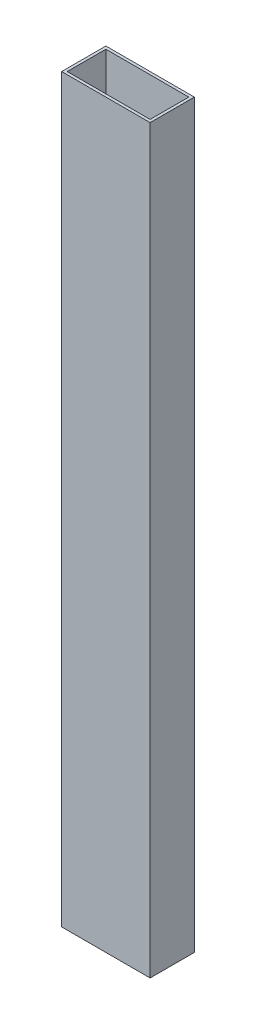
ISO-10303-21;
HEADER;
FILE_DESCRIPTION(('STEP AP214'),'2;1');
FILE_NAME('part.step','',(''),(''),'','','');
FILE_SCHEMA(('AUTOMOTIVE_DESIGN { 1 0 10303 214 1 1 1 1 }'));
ENDSEC;
DATA;
#1=APPLICATION_CONTEXT('core data for automotive mechanical design processes');
#2=APPLICATION_PROTOCOL_DEFINITION('international standard','automotive_design',2000,#1);
#3=PRODUCT_CONTEXT('',#1,'mechanical');
#4=PRODUCT('Part','Part','',(#3));
#5=PRODUCT_RELATED_PRODUCT_CATEGORY('part','',(#4));
#6=PRODUCT_DEFINITION_FORMATION('','',#4);
#7=PRODUCT_DEFINITION_CONTEXT('part definition',#1,'design');
#8=PRODUCT_DEFINITION('design','',#6,#7);
#9=PRODUCT_DEFINITION_SHAPE('','',#8);
#10=(LENGTH_UNIT() NAMED_UNIT(*) SI_UNIT(.MILLI.,.METRE.));
#11=(NAMED_UNIT(*) PLANE_ANGLE_UNIT() SI_UNIT($,.RADIAN.));
#12=(NAMED_UNIT(*) SI_UNIT($,.STERADIAN.) SOLID_ANGLE_UNIT());
#13=UNCERTAINTY_MEASURE_WITH_UNIT(LENGTH_MEASURE(1.E-05),#10,'distance_accuracy_value','');
#14=(GEOMETRIC_REPRESENTATION_CONTEXT(3) GLOBAL_UNCERTAINTY_ASSIGNED_CONTEXT((#13)) GLOBAL_UNIT_ASSIGNED_CONTEXT((#10,
#11,#12)) REPRESENTATION_CONTEXT('',''));
#15=CARTESIAN_POINT('',(0.,0.,0.));
#16=DIRECTION('',(0.,0.,1.));
#17=DIRECTION('',(1.,0.,0.));
#18=AXIS2_PLACEMENT_3D('',#15,#16,#17);
#19=CARTESIAN_POINT('',(0.,425.45,0.));
#20=DIRECTION('',(0.,1.,0.));
#21=DIRECTION('',(0.,0.,1.));
#22=AXIS2_PLACEMENT_3D('',#19,#20,#21);
#23=PLANE('',#22);
#24=DIRECTION('',(0.,0.,1.));
#25=VECTOR('',#24,1.);
#26=CARTESIAN_POINT('',(-49.2125,425.45,-23.8125));
#27=LINE('',#26,#25);
#28=CARTESIAN_POINT('',(-49.2125,425.45,-23.8125));
#29=VERTEX_POINT('',#28);
#30=CARTESIAN_POINT('',(-49.2125,425.45,1.5875));
#31=VERTEX_POINT('',#30);
#32=EDGE_CURVE('E155',#29,#31,#27,.T.);
#33=ORIENTED_EDGE('',*,*,#32,.T.);
#34=DIRECTION('',(1.,0.,0.));
#35=VECTOR('',#34,1.);
#36=CARTESIAN_POINT('',(-49.2125,425.45,1.5875));
#37=LINE('',#36,#35);
#38=CARTESIAN_POINT('',(1.5875,425.45,1.5875));
#39=VERTEX_POINT('',#38);
#40=EDGE_CURVE('E159',#31,#39,#37,.T.);
#41=ORIENTED_EDGE('',*,*,#40,.T.);
#42=DIRECTION('',(0.,0.,-1.));
#43=VECTOR('',#42,1.);
#44=CARTESIAN_POINT('',(1.5875,425.45,-23.8125));
#45=LINE('',#44,#43);
#46=CARTESIAN_POINT('',(1.5875,425.45,-23.8125));
#47=VERTEX_POINT('',#46);
#48=EDGE_CURVE('E163',#39,#47,#45,.T.);
#49=ORIENTED_EDGE('',*,*,#48,.T.);
#50=DIRECTION('',(-1.,0.,0.));
#51=VECTOR('',#50,1.);
#52=CARTESIAN_POINT('',(-49.2125,425.45,-23.8125));
#53=LINE('',#52,#51);
#54=EDGE_CURVE('E166',#47,#29,#53,.T.);
#55=ORIENTED_EDGE('',*,*,#54,.T.);
#56=EDGE_LOOP('',(#33,#41,#49,#55));
#57=FACE_BOUND('',#56,.T.);
#58=DIRECTION('',(1.,0.,0.));
#59=VECTOR('',#58,1.);
#60=CARTESIAN_POINT('',(-47.625,425.45,0.));
#61=LINE('',#60,#59);
#62=CARTESIAN_POINT('',(-47.625,425.45,0.));
#63=VERTEX_POINT('',#62);
#64=CARTESIAN_POINT('',(0.,425.45,0.));
#65=VERTEX_POINT('',#64);
#66=EDGE_CURVE('E116',#63,#65,#61,.T.);
#67=ORIENTED_EDGE('',*,*,#66,.F.);
#68=DIRECTION('',(0.,0.,1.));
#69=VECTOR('',#68,1.);
#70=CARTESIAN_POINT('',(-47.625,425.45,-22.225));
#71=LINE('',#70,#69);
#72=CARTESIAN_POINT('',(-47.625,425.45,-22.225));
#73=VERTEX_POINT('',#72);
#74=EDGE_CURVE('E107',#73,#63,#71,.T.);
#75=ORIENTED_EDGE('',*,*,#74,.F.);
#76=DIRECTION('',(-1.,0.,0.));
#77=VECTOR('',#76,1.);
#78=CARTESIAN_POINT('',(-47.625,425.45,-22.225));
#79=LINE('',#78,#77);
#80=CARTESIAN_POINT('',(0.,425.45,-22.225));
#81=VERTEX_POINT('',#80);
#82=EDGE_CURVE('E133',#81,#73,#79,.T.);
#83=ORIENTED_EDGE('',*,*,#82,.F.);
#84=DIRECTION('',(0.,0.,-1.));
#85=VECTOR('',#84,1.);
#86=CARTESIAN_POINT('',(0.,425.45,-22.225));
#87=LINE('',#86,#85);
#88=EDGE_CURVE('E129',#65,#81,#87,.T.);
#89=ORIENTED_EDGE('',*,*,#88,.F.);
#90=EDGE_LOOP('',(#67,#75,#83,#89));
#91=FACE_BOUND('',#90,.T.);
#92=ADVANCED_FACE('F41',(#57,#91),#23,.T.);
#93=CARTESIAN_POINT('',(0.,0.,0.));
#94=DIRECTION('',(0.,1.,0.));
#95=DIRECTION('',(0.,0.,1.));
#96=AXIS2_PLACEMENT_3D('',#93,#94,#95);
#97=PLANE('',#96);
#98=DIRECTION('',(0.,0.,1.));
#99=VECTOR('',#98,1.);
#100=CARTESIAN_POINT('',(-49.2125,0.,-23.8125));
#101=LINE('',#100,#99);
#102=CARTESIAN_POINT('',(-49.2125,0.,-23.8125));
#103=VERTEX_POINT('',#102);
#104=CARTESIAN_POINT('',(-49.2125,0.,1.5875));
#105=VERTEX_POINT('',#104);
#106=EDGE_CURVE('E125',#103,#105,#101,.T.);
#107=ORIENTED_EDGE('',*,*,#106,.F.);
#108=DIRECTION('',(-1.,0.,0.));
#109=VECTOR('',#108,1.);
#110=CARTESIAN_POINT('',(-49.2125,0.,-23.8125));
#111=LINE('',#110,#109);
#112=CARTESIAN_POINT('',(1.5875,0.,-23.8125));
#113=VERTEX_POINT('',#112);
#114=EDGE_CURVE('E160',#113,#103,#111,.T.);
#115=ORIENTED_EDGE('',*,*,#114,.F.);
#116=DIRECTION('',(0.,0.,-1.));
#117=VECTOR('',#116,1.);
#118=CARTESIAN_POINT('',(1.5875,0.,-23.8125));
#119=LINE('',#118,#117);
#120=CARTESIAN_POINT('',(1.5875,0.,1.5875));
#121=VERTEX_POINT('',#120);
#122=EDGE_CURVE('E176',#121,#113,#119,.T.);
#123=ORIENTED_EDGE('',*,*,#122,.F.);
#124=DIRECTION('',(1.,0.,0.));
#125=VECTOR('',#124,1.);
#126=CARTESIAN_POINT('',(-49.2125,0.,1.5875));
#127=LINE('',#126,#125);
#128=EDGE_CURVE('E173',#105,#121,#127,.T.);
#129=ORIENTED_EDGE('',*,*,#128,.F.);
#130=EDGE_LOOP('',(#107,#115,#123,#129));
#131=FACE_BOUND('',#130,.T.);
#132=DIRECTION('',(0.,0.,1.));
#133=VECTOR('',#132,1.);
#134=CARTESIAN_POINT('',(-47.625,0.,-22.225));
#135=LINE('',#134,#133);
#136=CARTESIAN_POINT('',(-47.625,0.,-22.225));
#137=VERTEX_POINT('',#136);
#138=CARTESIAN_POINT('',(-47.625,0.,0.));
#139=VERTEX_POINT('',#138);
#140=EDGE_CURVE('E65',#137,#139,#135,.T.);
#141=ORIENTED_EDGE('',*,*,#140,.T.);
#142=DIRECTION('',(1.,0.,0.));
#143=VECTOR('',#142,1.);
#144=CARTESIAN_POINT('',(-47.625,0.,0.));
#145=LINE('',#144,#143);
#146=CARTESIAN_POINT('',(0.,0.,0.));
#147=VERTEX_POINT('',#146);
#148=EDGE_CURVE('E123',#139,#147,#145,.T.);
#149=ORIENTED_EDGE('',*,*,#148,.T.);
#150=DIRECTION('',(0.,0.,-1.));
#151=VECTOR('',#150,1.);
#152=CARTESIAN_POINT('',(0.,0.,-22.225));
#153=LINE('',#152,#151);
#154=CARTESIAN_POINT('',(0.,0.,-22.225));
#155=VERTEX_POINT('',#154);
#156=EDGE_CURVE('E142',#147,#155,#153,.T.);
#157=ORIENTED_EDGE('',*,*,#156,.T.);
#158=DIRECTION('',(-1.,0.,0.));
#159=VECTOR('',#158,1.);
#160=CARTESIAN_POINT('',(-47.625,0.,-22.225));
#161=LINE('',#160,#159);
#162=EDGE_CURVE('E117',#155,#137,#161,.T.);
#163=ORIENTED_EDGE('',*,*,#162,.T.);
#164=EDGE_LOOP('',(#141,#149,#157,#163));
#165=FACE_BOUND('',#164,.T.);
#166=ADVANCED_FACE('F199',(#131,#165),#97,.F.);
#167=CARTESIAN_POINT('',(-49.2125,425.45,-23.8125));
#168=DIRECTION('',(1.,0.,0.));
#169=DIRECTION('',(0.,0.,-1.));
#170=AXIS2_PLACEMENT_3D('',#167,#168,#169);
#171=PLANE('',#170);
#172=ORIENTED_EDGE('',*,*,#106,.T.);
#173=DIRECTION('',(0.,-1.,0.));
#174=VECTOR('',#173,1.);
#175=CARTESIAN_POINT('',(-49.2125,425.45,1.5875));
#176=LINE('',#175,#174);
#177=EDGE_CURVE('E11',#31,#105,#176,.T.);
#178=ORIENTED_EDGE('',*,*,#177,.F.);
#179=ORIENTED_EDGE('',*,*,#32,.F.);
#180=DIRECTION('',(0.,-1.,0.));
#181=VECTOR('',#180,1.);
#182=CARTESIAN_POINT('',(-49.2125,425.45,-23.8125));
#183=LINE('',#182,#181);
#184=EDGE_CURVE('E169',#29,#103,#183,.T.);
#185=ORIENTED_EDGE('',*,*,#184,.T.);
#186=EDGE_LOOP('',(#172,#178,#179,#185));
#187=FACE_BOUND('',#186,.T.);
#188=ADVANCED_FACE('F43',(#187),#171,.F.);
#189=CARTESIAN_POINT('',(-49.2125,425.45,1.5875));
#190=DIRECTION('',(0.,0.,-1.));
#191=DIRECTION('',(-1.,0.,0.));
#192=AXIS2_PLACEMENT_3D('',#189,#190,#191);
#193=PLANE('',#192);
#194=ORIENTED_EDGE('',*,*,#128,.T.);
#195=DIRECTION('',(0.,-1.,0.));
#196=VECTOR('',#195,1.);
#197=CARTESIAN_POINT('',(1.5875,425.45,1.5875));
#198=LINE('',#197,#196);
#199=EDGE_CURVE('E50',#39,#121,#198,.T.);
#200=ORIENTED_EDGE('',*,*,#199,.F.);
#201=ORIENTED_EDGE('',*,*,#40,.F.);
#202=ORIENTED_EDGE('',*,*,#177,.T.);
#203=EDGE_LOOP('',(#194,#200,#201,#202));
#204=FACE_BOUND('',#203,.T.);
#205=ADVANCED_FACE('F209',(#204),#193,.F.);
#206=CARTESIAN_POINT('',(1.5875,425.45,-23.8125));
#207=DIRECTION('',(-1.,0.,0.));
#208=DIRECTION('',(0.,0.,1.));
#209=AXIS2_PLACEMENT_3D('',#206,#207,#208);
#210=PLANE('',#209);
#211=ORIENTED_EDGE('',*,*,#122,.T.);
#212=DIRECTION('',(0.,-1.,0.));
#213=VECTOR('',#212,1.);
#214=CARTESIAN_POINT('',(1.5875,425.45,-23.8125));
#215=LINE('',#214,#213);
#216=EDGE_CURVE('E184',#47,#113,#215,.T.);
#217=ORIENTED_EDGE('',*,*,#216,.F.);
#218=ORIENTED_EDGE('',*,*,#48,.F.);
#219=ORIENTED_EDGE('',*,*,#199,.T.);
#220=EDGE_LOOP('',(#211,#217,#218,#219));
#221=FACE_BOUND('',#220,.T.);
#222=ADVANCED_FACE('F193',(#221),#210,.F.);
#223=CARTESIAN_POINT('',(-49.2125,425.45,-23.8125));
#224=DIRECTION('',(0.,0.,1.));
#225=DIRECTION('',(1.,0.,0.));
#226=AXIS2_PLACEMENT_3D('',#223,#224,#225);
#227=PLANE('',#226);
#228=ORIENTED_EDGE('',*,*,#114,.T.);
#229=ORIENTED_EDGE('',*,*,#184,.F.);
#230=ORIENTED_EDGE('',*,*,#54,.F.);
#231=ORIENTED_EDGE('',*,*,#216,.T.);
#232=EDGE_LOOP('',(#228,#229,#230,#231));
#233=FACE_BOUND('',#232,.T.);
#234=ADVANCED_FACE('F203',(#233),#227,.F.);
#235=CARTESIAN_POINT('',(-47.625,425.45,-22.225));
#236=DIRECTION('',(1.,0.,0.));
#237=DIRECTION('',(0.,0.,-1.));
#238=AXIS2_PLACEMENT_3D('',#235,#236,#237);
#239=PLANE('',#238);
#240=ORIENTED_EDGE('',*,*,#140,.F.);
#241=DIRECTION('',(0.,-1.,0.));
#242=VECTOR('',#241,1.);
#243=CARTESIAN_POINT('',(-47.625,425.45,-22.225));
#244=LINE('',#243,#242);
#245=EDGE_CURVE('E111',#73,#137,#244,.T.);
#246=ORIENTED_EDGE('',*,*,#245,.F.);
#247=ORIENTED_EDGE('',*,*,#74,.T.);
#248=DIRECTION('',(0.,-1.,0.));
#249=VECTOR('',#248,1.);
#250=CARTESIAN_POINT('',(-47.625,425.45,0.));
#251=LINE('',#250,#249);
#252=EDGE_CURVE('E110',#63,#139,#251,.T.);
#253=ORIENTED_EDGE('',*,*,#252,.T.);
#254=EDGE_LOOP('',(#240,#246,#247,#253));
#255=FACE_BOUND('',#254,.T.);
#256=ADVANCED_FACE('F109',(#255),#239,.T.);
#257=CARTESIAN_POINT('',(-47.625,425.45,0.));
#258=DIRECTION('',(0.,0.,-1.));
#259=DIRECTION('',(-1.,0.,0.));
#260=AXIS2_PLACEMENT_3D('',#257,#258,#259);
#261=PLANE('',#260);
#262=ORIENTED_EDGE('',*,*,#148,.F.);
#263=ORIENTED_EDGE('',*,*,#252,.F.);
#264=ORIENTED_EDGE('',*,*,#66,.T.);
#265=DIRECTION('',(0.,-1.,0.));
#266=VECTOR('',#265,1.);
#267=CARTESIAN_POINT('',(0.,425.45,0.));
#268=LINE('',#267,#266);
#269=EDGE_CURVE('E126',#65,#147,#268,.T.);
#270=ORIENTED_EDGE('',*,*,#269,.T.);
#271=EDGE_LOOP('',(#262,#263,#264,#270));
#272=FACE_BOUND('',#271,.T.);
#273=ADVANCED_FACE('F120',(#272),#261,.T.);
#274=CARTESIAN_POINT('',(0.,425.45,-22.225));
#275=DIRECTION('',(-1.,0.,0.));
#276=DIRECTION('',(0.,0.,1.));
#277=AXIS2_PLACEMENT_3D('',#274,#275,#276);
#278=PLANE('',#277);
#279=ORIENTED_EDGE('',*,*,#156,.F.);
#280=ORIENTED_EDGE('',*,*,#269,.F.);
#281=ORIENTED_EDGE('',*,*,#88,.T.);
#282=DIRECTION('',(0.,-1.,0.));
#283=VECTOR('',#282,1.);
#284=CARTESIAN_POINT('',(0.,425.45,-22.225));
#285=LINE('',#284,#283);
#286=EDGE_CURVE('E57',#81,#155,#285,.T.);
#287=ORIENTED_EDGE('',*,*,#286,.T.);
#288=EDGE_LOOP('',(#279,#280,#281,#287));
#289=FACE_BOUND('',#288,.T.);
#290=ADVANCED_FACE('F232',(#289),#278,.T.);
#291=CARTESIAN_POINT('',(-47.625,425.45,-22.225));
#292=DIRECTION('',(0.,0.,1.));
#293=DIRECTION('',(1.,0.,0.));
#294=AXIS2_PLACEMENT_3D('',#291,#292,#293);
#295=PLANE('',#294);
#296=ORIENTED_EDGE('',*,*,#162,.F.);
#297=ORIENTED_EDGE('',*,*,#286,.F.);
#298=ORIENTED_EDGE('',*,*,#82,.T.);
#299=ORIENTED_EDGE('',*,*,#245,.T.);
#300=EDGE_LOOP('',(#296,#297,#298,#299));
#301=FACE_BOUND('',#300,.T.);
#302=ADVANCED_FACE('F236',(#301),#295,.T.);
#303=CLOSED_SHELL('',(#92,#166,#188,#205,#222,#234,#256,#273,#290,#302));
#304=MANIFOLD_SOLID_BREP('B2',#303);
#305=ADVANCED_BREP_SHAPE_REPRESENTATION('',(#18,#304),#14);
#306=SHAPE_DEFINITION_REPRESENTATION(#9,#305);
ENDSEC;
END-ISO-10303-21;
